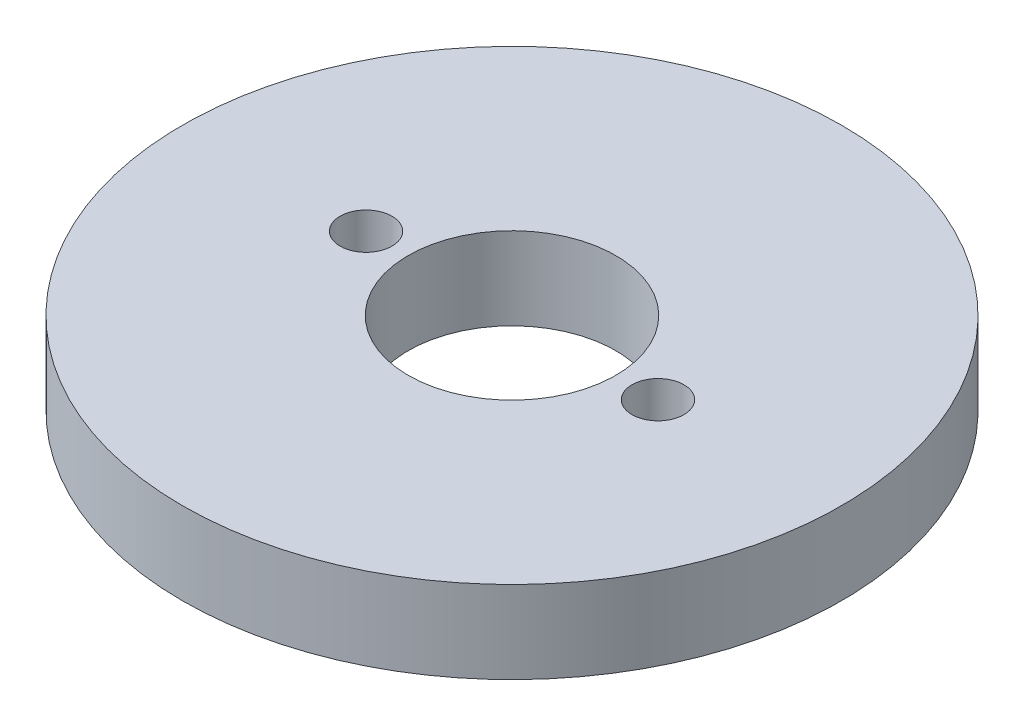
ISO-10303-21;
HEADER;
FILE_DESCRIPTION(('STEP AP214'),'2;1');
FILE_NAME('part.step','',(''),(''),'','','');
FILE_SCHEMA(('AUTOMOTIVE_DESIGN { 1 0 10303 214 1 1 1 1 }'));
ENDSEC;
DATA;
#1=APPLICATION_CONTEXT('core data for automotive mechanical design processes');
#2=APPLICATION_PROTOCOL_DEFINITION('international standard','automotive_design',2000,#1);
#3=PRODUCT_CONTEXT('',#1,'mechanical');
#4=PRODUCT('Part','Part','',(#3));
#5=PRODUCT_RELATED_PRODUCT_CATEGORY('part','',(#4));
#6=PRODUCT_DEFINITION_FORMATION('','',#4);
#7=PRODUCT_DEFINITION_CONTEXT('part definition',#1,'design');
#8=PRODUCT_DEFINITION('design','',#6,#7);
#9=PRODUCT_DEFINITION_SHAPE('','',#8);
#10=(LENGTH_UNIT() NAMED_UNIT(*) SI_UNIT(.MILLI.,.METRE.));
#11=(NAMED_UNIT(*) PLANE_ANGLE_UNIT() SI_UNIT($,.RADIAN.));
#12=(NAMED_UNIT(*) SI_UNIT($,.STERADIAN.) SOLID_ANGLE_UNIT());
#13=UNCERTAINTY_MEASURE_WITH_UNIT(LENGTH_MEASURE(1.E-05),#10,'distance_accuracy_value','');
#14=(GEOMETRIC_REPRESENTATION_CONTEXT(3) GLOBAL_UNCERTAINTY_ASSIGNED_CONTEXT((#13)) GLOBAL_UNIT_ASSIGNED_CONTEXT((#10,
#11,#12)) REPRESENTATION_CONTEXT('',''));
#15=CARTESIAN_POINT('',(0.,0.,0.));
#16=DIRECTION('',(0.,0.,1.));
#17=DIRECTION('',(1.,0.,0.));
#18=AXIS2_PLACEMENT_3D('',#15,#16,#17);
#19=CARTESIAN_POINT('',(0.,12.7,0.));
#20=DIRECTION('',(0.,1.,0.));
#21=DIRECTION('',(0.,0.,1.));
#22=AXIS2_PLACEMENT_3D('',#19,#20,#21);
#23=PLANE('',#22);
#24=CARTESIAN_POINT('',(22.5,12.7,0.));
#25=DIRECTION('',(0.,1.,0.));
#26=DIRECTION('',(0.,0.,1.));
#27=AXIS2_PLACEMENT_3D('',#24,#25,#26);
#28=CIRCLE('',#27,4.00000000000001);
#29=CARTESIAN_POINT('',(22.5,12.7,4.00000000000001));
#30=VERTEX_POINT('',#29);
#31=EDGE_CURVE('E54',#30,#30,#28,.T.);
#32=ORIENTED_EDGE('',*,*,#31,.F.);
#33=EDGE_LOOP('',(#32));
#34=FACE_BOUND('',#33,.T.);
#35=CARTESIAN_POINT('',(-22.5,12.7,0.));
#36=DIRECTION('',(0.,1.,0.));
#37=DIRECTION('',(0.,0.,1.));
#38=AXIS2_PLACEMENT_3D('',#35,#36,#37);
#39=CIRCLE('',#38,4.00000000000001);
#40=CARTESIAN_POINT('',(-22.5,12.7,4.00000000000001));
#41=VERTEX_POINT('',#40);
#42=EDGE_CURVE('E48',#41,#41,#39,.T.);
#43=ORIENTED_EDGE('',*,*,#42,.F.);
#44=EDGE_LOOP('',(#43));
#45=FACE_BOUND('',#44,.T.);
#46=CARTESIAN_POINT('',(0.,12.7,0.));
#47=DIRECTION('',(0.,1.,0.));
#48=DIRECTION('',(0.,0.,1.));
#49=AXIS2_PLACEMENT_3D('',#46,#47,#48);
#50=CIRCLE('',#49,50.8);
#51=CARTESIAN_POINT('',(0.,12.7,50.8));
#52=VERTEX_POINT('',#51);
#53=EDGE_CURVE('E10',#52,#52,#50,.T.);
#54=ORIENTED_EDGE('',*,*,#53,.T.);
#55=EDGE_LOOP('',(#54));
#56=FACE_BOUND('',#55,.T.);
#57=CARTESIAN_POINT('',(0.,12.7,0.));
#58=DIRECTION('',(0.,1.,0.));
#59=DIRECTION('',(0.,0.,1.));
#60=AXIS2_PLACEMENT_3D('',#57,#58,#59);
#61=CIRCLE('',#60,16.);
#62=CARTESIAN_POINT('',(0.,12.7,16.));
#63=VERTEX_POINT('',#62);
#64=EDGE_CURVE('E40',#63,#63,#61,.T.);
#65=ORIENTED_EDGE('',*,*,#64,.F.);
#66=EDGE_LOOP('',(#65));
#67=FACE_BOUND('',#66,.T.);
#68=ADVANCED_FACE('F29',(#34,#45,#56,#67),#23,.T.);
#69=CARTESIAN_POINT('',(0.,0.,0.));
#70=DIRECTION('',(0.,1.,0.));
#71=DIRECTION('',(0.,0.,1.));
#72=AXIS2_PLACEMENT_3D('',#69,#70,#71);
#73=PLANE('',#72);
#74=CARTESIAN_POINT('',(22.5,0.,0.));
#75=DIRECTION('',(0.,1.,0.));
#76=DIRECTION('',(0.,0.,1.));
#77=AXIS2_PLACEMENT_3D('',#74,#75,#76);
#78=CIRCLE('',#77,4.00000000000001);
#79=CARTESIAN_POINT('',(22.5,0.,4.00000000000001));
#80=VERTEX_POINT('',#79);
#81=EDGE_CURVE('E51',#80,#80,#78,.T.);
#82=ORIENTED_EDGE('',*,*,#81,.T.);
#83=EDGE_LOOP('',(#82));
#84=FACE_BOUND('',#83,.T.);
#85=CARTESIAN_POINT('',(-22.5,0.,0.));
#86=DIRECTION('',(0.,1.,0.));
#87=DIRECTION('',(0.,0.,1.));
#88=AXIS2_PLACEMENT_3D('',#85,#86,#87);
#89=CIRCLE('',#88,4.00000000000001);
#90=CARTESIAN_POINT('',(-22.5,0.,4.00000000000001));
#91=VERTEX_POINT('',#90);
#92=EDGE_CURVE('E45',#91,#91,#89,.T.);
#93=ORIENTED_EDGE('',*,*,#92,.T.);
#94=EDGE_LOOP('',(#93));
#95=FACE_BOUND('',#94,.T.);
#96=CARTESIAN_POINT('',(0.,0.,0.));
#97=DIRECTION('',(0.,1.,0.));
#98=DIRECTION('',(0.,0.,1.));
#99=AXIS2_PLACEMENT_3D('',#96,#97,#98);
#100=CIRCLE('',#99,50.8);
#101=CARTESIAN_POINT('',(0.,0.,50.8));
#102=VERTEX_POINT('',#101);
#103=EDGE_CURVE('E33',#102,#102,#100,.T.);
#104=ORIENTED_EDGE('',*,*,#103,.F.);
#105=EDGE_LOOP('',(#104));
#106=FACE_BOUND('',#105,.T.);
#107=CARTESIAN_POINT('',(0.,0.,0.));
#108=DIRECTION('',(0.,1.,0.));
#109=DIRECTION('',(0.,0.,1.));
#110=AXIS2_PLACEMENT_3D('',#107,#108,#109);
#111=CIRCLE('',#110,16.);
#112=CARTESIAN_POINT('',(0.,0.,16.));
#113=VERTEX_POINT('',#112);
#114=EDGE_CURVE('E42',#113,#113,#111,.T.);
#115=ORIENTED_EDGE('',*,*,#114,.T.);
#116=EDGE_LOOP('',(#115));
#117=FACE_BOUND('',#116,.T.);
#118=ADVANCED_FACE('F60',(#84,#95,#106,#117),#73,.F.);
#119=CARTESIAN_POINT('',(0.,12.7,0.));
#120=DIRECTION('',(0.,-1.,0.));
#121=DIRECTION('',(0.,0.,-1.));
#122=AXIS2_PLACEMENT_3D('',#119,#120,#121);
#123=CYLINDRICAL_SURFACE('',#122,50.8);
#124=ORIENTED_EDGE('',*,*,#53,.F.);
#125=EDGE_LOOP('',(#124));
#126=FACE_BOUND('',#125,.T.);
#127=ORIENTED_EDGE('',*,*,#103,.T.);
#128=EDGE_LOOP('',(#127));
#129=FACE_BOUND('',#128,.T.);
#130=ADVANCED_FACE('F31',(#126,#129),#123,.T.);
#131=CARTESIAN_POINT('',(0.,12.7,0.));
#132=DIRECTION('',(0.,-1.,0.));
#133=DIRECTION('',(0.,0.,-1.));
#134=AXIS2_PLACEMENT_3D('',#131,#132,#133);
#135=CYLINDRICAL_SURFACE('',#134,16.);
#136=ORIENTED_EDGE('',*,*,#64,.T.);
#137=EDGE_LOOP('',(#136));
#138=FACE_BOUND('',#137,.T.);
#139=ORIENTED_EDGE('',*,*,#114,.F.);
#140=EDGE_LOOP('',(#139));
#141=FACE_BOUND('',#140,.T.);
#142=ADVANCED_FACE('F77',(#138,#141),#135,.F.);
#143=CARTESIAN_POINT('',(-22.5,0.,0.));
#144=DIRECTION('',(0.,1.,0.));
#145=DIRECTION('',(0.,0.,1.));
#146=AXIS2_PLACEMENT_3D('',#143,#144,#145);
#147=CYLINDRICAL_SURFACE('',#146,4.00000000000001);
#148=ORIENTED_EDGE('',*,*,#92,.F.);
#149=EDGE_LOOP('',(#148));
#150=FACE_BOUND('',#149,.T.);
#151=ORIENTED_EDGE('',*,*,#42,.T.);
#152=EDGE_LOOP('',(#151));
#153=FACE_BOUND('',#152,.T.);
#154=ADVANCED_FACE('F66',(#150,#153),#147,.F.);
#155=CARTESIAN_POINT('',(22.5,0.,0.));
#156=DIRECTION('',(0.,1.,0.));
#157=DIRECTION('',(0.,0.,1.));
#158=AXIS2_PLACEMENT_3D('',#155,#156,#157);
#159=CYLINDRICAL_SURFACE('',#158,4.00000000000001);
#160=ORIENTED_EDGE('',*,*,#81,.F.);
#161=EDGE_LOOP('',(#160));
#162=FACE_BOUND('',#161,.T.);
#163=ORIENTED_EDGE('',*,*,#31,.T.);
#164=EDGE_LOOP('',(#163));
#165=FACE_BOUND('',#164,.T.);
#166=ADVANCED_FACE('F63',(#162,#165),#159,.F.);
#167=CLOSED_SHELL('',(#68,#118,#130,#142,#154,#166));
#168=MANIFOLD_SOLID_BREP('B2',#167);
#169=ADVANCED_BREP_SHAPE_REPRESENTATION('',(#18,#168),#14);
#170=SHAPE_DEFINITION_REPRESENTATION(#9,#169);
ENDSEC;
END-ISO-10303-21;
